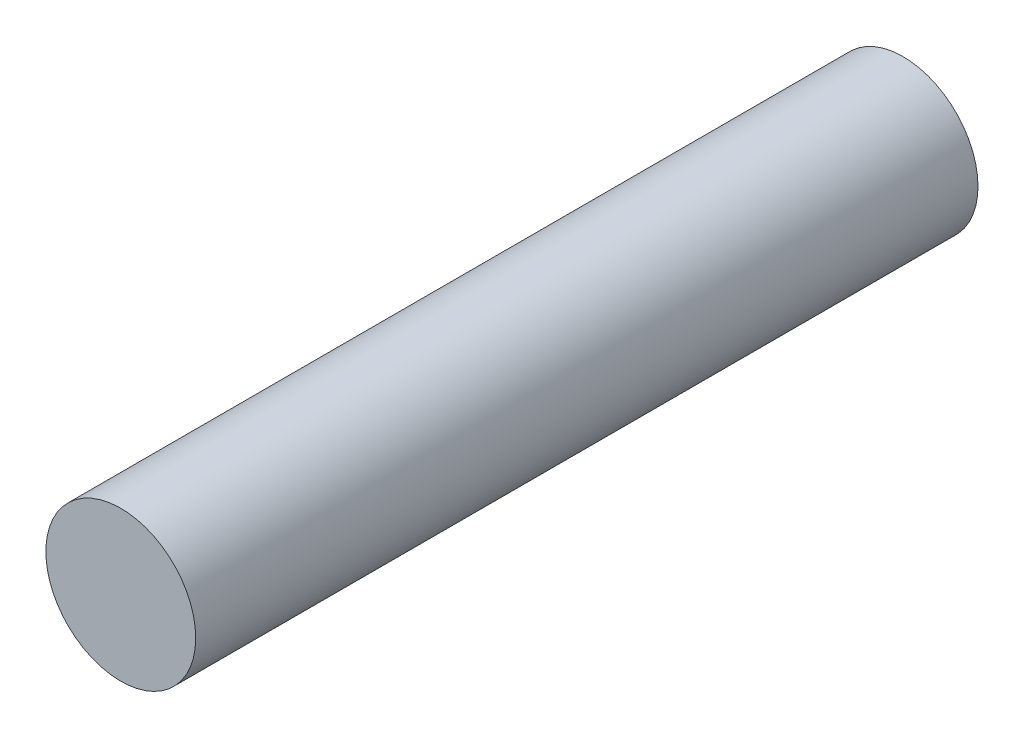
ISO-10303-21;
HEADER;
FILE_DESCRIPTION(('STEP AP214'),'2;1');
FILE_NAME('part.step','',(''),(''),'','','');
FILE_SCHEMA(('AUTOMOTIVE_DESIGN { 1 0 10303 214 1 1 1 1 }'));
ENDSEC;
DATA;
#1=APPLICATION_CONTEXT('core data for automotive mechanical design processes');
#2=APPLICATION_PROTOCOL_DEFINITION('international standard','automotive_design',2000,#1);
#3=PRODUCT_CONTEXT('',#1,'mechanical');
#4=PRODUCT('Part','Part','',(#3));
#5=PRODUCT_RELATED_PRODUCT_CATEGORY('part','',(#4));
#6=PRODUCT_DEFINITION_FORMATION('','',#4);
#7=PRODUCT_DEFINITION_CONTEXT('part definition',#1,'design');
#8=PRODUCT_DEFINITION('design','',#6,#7);
#9=PRODUCT_DEFINITION_SHAPE('','',#8);
#10=(LENGTH_UNIT() NAMED_UNIT(*) SI_UNIT(.MILLI.,.METRE.));
#11=(NAMED_UNIT(*) PLANE_ANGLE_UNIT() SI_UNIT($,.RADIAN.));
#12=(NAMED_UNIT(*) SI_UNIT($,.STERADIAN.) SOLID_ANGLE_UNIT());
#13=UNCERTAINTY_MEASURE_WITH_UNIT(LENGTH_MEASURE(1.E-05),#10,'distance_accuracy_value','');
#14=(GEOMETRIC_REPRESENTATION_CONTEXT(3) GLOBAL_UNCERTAINTY_ASSIGNED_CONTEXT((#13)) GLOBAL_UNIT_ASSIGNED_CONTEXT((#10,
#11,#12)) REPRESENTATION_CONTEXT('',''));
#15=CARTESIAN_POINT('',(0.,0.,0.));
#16=DIRECTION('',(0.,0.,1.));
#17=DIRECTION('',(1.,0.,0.));
#18=AXIS2_PLACEMENT_3D('',#15,#16,#17);
#19=CARTESIAN_POINT('',(0.,0.,16.51));
#20=DIRECTION('',(0.,0.,-1.));
#21=DIRECTION('',(-1.,0.,0.));
#22=AXIS2_PLACEMENT_3D('',#19,#20,#21);
#23=CYLINDRICAL_SURFACE('',#22,1.58115);
#24=CARTESIAN_POINT('',(0.,0.,16.51));
#25=DIRECTION('',(0.,0.,1.));
#26=DIRECTION('',(1.,0.,0.));
#27=AXIS2_PLACEMENT_3D('',#24,#25,#26);
#28=CIRCLE('',#27,1.58115);
#29=CARTESIAN_POINT('',(1.58115,0.,16.51));
#30=VERTEX_POINT('',#29);
#31=EDGE_CURVE('E10',#30,#30,#28,.T.);
#32=ORIENTED_EDGE('',*,*,#31,.F.);
#33=EDGE_LOOP('',(#32));
#34=FACE_BOUND('',#33,.T.);
#35=CARTESIAN_POINT('',(0.,0.,0.));
#36=DIRECTION('',(0.,0.,1.));
#37=DIRECTION('',(1.,0.,0.));
#38=AXIS2_PLACEMENT_3D('',#35,#36,#37);
#39=CIRCLE('',#38,1.58115);
#40=CARTESIAN_POINT('',(1.58115,0.,0.));
#41=VERTEX_POINT('',#40);
#42=EDGE_CURVE('E34',#41,#41,#39,.T.);
#43=ORIENTED_EDGE('',*,*,#42,.T.);
#44=EDGE_LOOP('',(#43));
#45=FACE_BOUND('',#44,.T.);
#46=ADVANCED_FACE('F31',(#34,#45),#23,.T.);
#47=CARTESIAN_POINT('',(0.,0.,16.51));
#48=DIRECTION('',(0.,0.,1.));
#49=DIRECTION('',(1.,0.,0.));
#50=AXIS2_PLACEMENT_3D('',#47,#48,#49);
#51=PLANE('',#50);
#52=ORIENTED_EDGE('',*,*,#31,.T.);
#53=EDGE_LOOP('',(#52));
#54=FACE_BOUND('',#53,.T.);
#55=ADVANCED_FACE('F46',(#54),#51,.T.);
#56=CARTESIAN_POINT('',(0.,0.,0.));
#57=DIRECTION('',(0.,0.,1.));
#58=DIRECTION('',(1.,0.,0.));
#59=AXIS2_PLACEMENT_3D('',#56,#57,#58);
#60=PLANE('',#59);
#61=ORIENTED_EDGE('',*,*,#42,.F.);
#62=EDGE_LOOP('',(#61));
#63=FACE_BOUND('',#62,.T.);
#64=ADVANCED_FACE('F44',(#63),#60,.F.);
#65=CLOSED_SHELL('',(#46,#55,#64));
#66=MANIFOLD_SOLID_BREP('B2',#65);
#67=ADVANCED_BREP_SHAPE_REPRESENTATION('',(#18,#66),#14);
#68=SHAPE_DEFINITION_REPRESENTATION(#9,#67);
ENDSEC;
END-ISO-10303-21;
